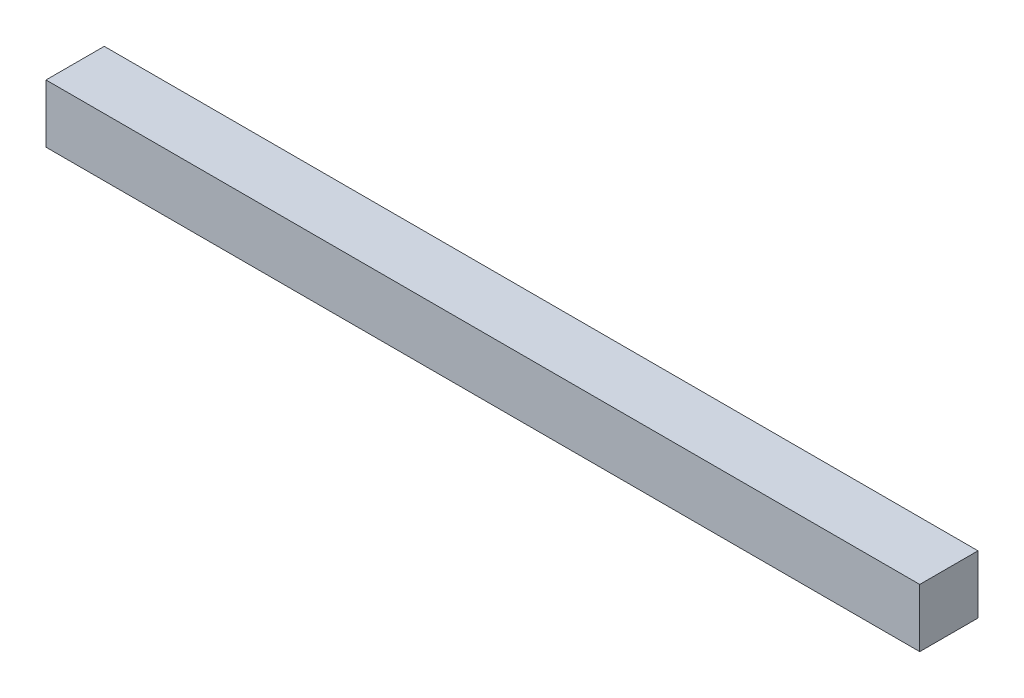
ISO-10303-21;
HEADER;
FILE_DESCRIPTION(('STEP AP214'),'2;1');
FILE_NAME('part.step','',(''),(''),'','','');
FILE_SCHEMA(('AUTOMOTIVE_DESIGN { 1 0 10303 214 1 1 1 1 }'));
ENDSEC;
DATA;
#1=APPLICATION_CONTEXT('core data for automotive mechanical design processes');
#2=APPLICATION_PROTOCOL_DEFINITION('international standard','automotive_design',2000,#1);
#3=PRODUCT_CONTEXT('',#1,'mechanical');
#4=PRODUCT('Part','Part','',(#3));
#5=PRODUCT_RELATED_PRODUCT_CATEGORY('part','',(#4));
#6=PRODUCT_DEFINITION_FORMATION('','',#4);
#7=PRODUCT_DEFINITION_CONTEXT('part definition',#1,'design');
#8=PRODUCT_DEFINITION('design','',#6,#7);
#9=PRODUCT_DEFINITION_SHAPE('','',#8);
#10=(LENGTH_UNIT() NAMED_UNIT(*) SI_UNIT(.MILLI.,.METRE.));
#11=(NAMED_UNIT(*) PLANE_ANGLE_UNIT() SI_UNIT($,.RADIAN.));
#12=(NAMED_UNIT(*) SI_UNIT($,.STERADIAN.) SOLID_ANGLE_UNIT());
#13=UNCERTAINTY_MEASURE_WITH_UNIT(LENGTH_MEASURE(1.E-05),#10,'distance_accuracy_value','');
#14=(GEOMETRIC_REPRESENTATION_CONTEXT(3) GLOBAL_UNCERTAINTY_ASSIGNED_CONTEXT((#13)) GLOBAL_UNIT_ASSIGNED_CONTEXT((#10,
#11,#12)) REPRESENTATION_CONTEXT('',''));
#15=CARTESIAN_POINT('',(0.,0.,0.));
#16=DIRECTION('',(0.,0.,1.));
#17=DIRECTION('',(1.,0.,0.));
#18=AXIS2_PLACEMENT_3D('',#15,#16,#17);
#19=CARTESIAN_POINT('',(75.,-5.,10.));
#20=DIRECTION('',(-1.,0.,0.));
#21=DIRECTION('',(0.,0.,1.));
#22=AXIS2_PLACEMENT_3D('',#19,#20,#21);
#23=PLANE('',#22);
#24=DIRECTION('',(0.,1.,0.));
#25=VECTOR('',#24,1.);
#26=CARTESIAN_POINT('',(75.,-5.,0.));
#27=LINE('',#26,#25);
#28=CARTESIAN_POINT('',(75.,-5.,0.));
#29=VERTEX_POINT('',#28);
#30=CARTESIAN_POINT('',(75.,5.,0.));
#31=VERTEX_POINT('',#30);
#32=EDGE_CURVE('E96',#29,#31,#27,.T.);
#33=ORIENTED_EDGE('',*,*,#32,.T.);
#34=DIRECTION('',(0.,0.,-1.));
#35=VECTOR('',#34,1.);
#36=CARTESIAN_POINT('',(75.,5.,10.));
#37=LINE('',#36,#35);
#38=CARTESIAN_POINT('',(75.,5.,10.));
#39=VERTEX_POINT('',#38);
#40=EDGE_CURVE('E11',#39,#31,#37,.T.);
#41=ORIENTED_EDGE('',*,*,#40,.F.);
#42=DIRECTION('',(0.,1.,0.));
#43=VECTOR('',#42,1.);
#44=CARTESIAN_POINT('',(75.,-5.,10.));
#45=LINE('',#44,#43);
#46=CARTESIAN_POINT('',(75.,-5.,10.));
#47=VERTEX_POINT('',#46);
#48=EDGE_CURVE('E84',#47,#39,#45,.T.);
#49=ORIENTED_EDGE('',*,*,#48,.F.);
#50=DIRECTION('',(0.,0.,-1.));
#51=VECTOR('',#50,1.);
#52=CARTESIAN_POINT('',(75.,-5.,10.));
#53=LINE('',#52,#51);
#54=EDGE_CURVE('E92',#47,#29,#53,.T.);
#55=ORIENTED_EDGE('',*,*,#54,.T.);
#56=EDGE_LOOP('',(#33,#41,#49,#55));
#57=FACE_BOUND('',#56,.T.);
#58=ADVANCED_FACE('F33',(#57),#23,.F.);
#59=CARTESIAN_POINT('',(-75.,5.,10.));
#60=DIRECTION('',(0.,-1.,0.));
#61=DIRECTION('',(0.,0.,-1.));
#62=AXIS2_PLACEMENT_3D('',#59,#60,#61);
#63=PLANE('',#62);
#64=DIRECTION('',(-1.,0.,0.));
#65=VECTOR('',#64,1.);
#66=CARTESIAN_POINT('',(-75.,5.,0.));
#67=LINE('',#66,#65);
#68=CARTESIAN_POINT('',(-75.,5.,0.));
#69=VERTEX_POINT('',#68);
#70=EDGE_CURVE('E88',#31,#69,#67,.T.);
#71=ORIENTED_EDGE('',*,*,#70,.T.);
#72=DIRECTION('',(0.,0.,-1.));
#73=VECTOR('',#72,1.);
#74=CARTESIAN_POINT('',(-75.,5.,10.));
#75=LINE('',#74,#73);
#76=CARTESIAN_POINT('',(-75.,5.,10.));
#77=VERTEX_POINT('',#76);
#78=EDGE_CURVE('E41',#77,#69,#75,.T.);
#79=ORIENTED_EDGE('',*,*,#78,.F.);
#80=DIRECTION('',(-1.,0.,0.));
#81=VECTOR('',#80,1.);
#82=CARTESIAN_POINT('',(-75.,5.,10.));
#83=LINE('',#82,#81);
#84=EDGE_CURVE('E79',#39,#77,#83,.T.);
#85=ORIENTED_EDGE('',*,*,#84,.F.);
#86=ORIENTED_EDGE('',*,*,#40,.T.);
#87=EDGE_LOOP('',(#71,#79,#85,#86));
#88=FACE_BOUND('',#87,.T.);
#89=ADVANCED_FACE('F87',(#88),#63,.F.);
#90=CARTESIAN_POINT('',(-75.,-5.,10.));
#91=DIRECTION('',(1.,0.,0.));
#92=DIRECTION('',(0.,0.,-1.));
#93=AXIS2_PLACEMENT_3D('',#90,#91,#92);
#94=PLANE('',#93);
#95=DIRECTION('',(0.,-1.,0.));
#96=VECTOR('',#95,1.);
#97=CARTESIAN_POINT('',(-75.,-5.,0.));
#98=LINE('',#97,#96);
#99=CARTESIAN_POINT('',(-75.,-5.,0.));
#100=VERTEX_POINT('',#99);
#101=EDGE_CURVE('E66',#69,#100,#98,.T.);
#102=ORIENTED_EDGE('',*,*,#101,.T.);
#103=DIRECTION('',(0.,0.,-1.));
#104=VECTOR('',#103,1.);
#105=CARTESIAN_POINT('',(-75.,-5.,10.));
#106=LINE('',#105,#104);
#107=CARTESIAN_POINT('',(-75.,-5.,10.));
#108=VERTEX_POINT('',#107);
#109=EDGE_CURVE('E89',#108,#100,#106,.T.);
#110=ORIENTED_EDGE('',*,*,#109,.F.);
#111=DIRECTION('',(0.,-1.,0.));
#112=VECTOR('',#111,1.);
#113=CARTESIAN_POINT('',(-75.,-5.,10.));
#114=LINE('',#113,#112);
#115=EDGE_CURVE('E82',#77,#108,#114,.T.);
#116=ORIENTED_EDGE('',*,*,#115,.F.);
#117=ORIENTED_EDGE('',*,*,#78,.T.);
#118=EDGE_LOOP('',(#102,#110,#116,#117));
#119=FACE_BOUND('',#118,.T.);
#120=ADVANCED_FACE('F90',(#119),#94,.F.);
#121=CARTESIAN_POINT('',(-75.,-5.,10.));
#122=DIRECTION('',(0.,1.,0.));
#123=DIRECTION('',(0.,0.,1.));
#124=AXIS2_PLACEMENT_3D('',#121,#122,#123);
#125=PLANE('',#124);
#126=DIRECTION('',(1.,0.,0.));
#127=VECTOR('',#126,1.);
#128=CARTESIAN_POINT('',(-75.,-5.,0.));
#129=LINE('',#128,#127);
#130=EDGE_CURVE('E72',#100,#29,#129,.T.);
#131=ORIENTED_EDGE('',*,*,#130,.T.);
#132=ORIENTED_EDGE('',*,*,#54,.F.);
#133=DIRECTION('',(1.,0.,0.));
#134=VECTOR('',#133,1.);
#135=CARTESIAN_POINT('',(-75.,-5.,10.));
#136=LINE('',#135,#134);
#137=EDGE_CURVE('E49',#108,#47,#136,.T.);
#138=ORIENTED_EDGE('',*,*,#137,.F.);
#139=ORIENTED_EDGE('',*,*,#109,.T.);
#140=EDGE_LOOP('',(#131,#132,#138,#139));
#141=FACE_BOUND('',#140,.T.);
#142=ADVANCED_FACE('F103',(#141),#125,.F.);
#143=CARTESIAN_POINT('',(0.,0.,10.));
#144=DIRECTION('',(0.,0.,-1.));
#145=DIRECTION('',(-1.,0.,0.));
#146=AXIS2_PLACEMENT_3D('',#143,#144,#145);
#147=PLANE('',#146);
#148=ORIENTED_EDGE('',*,*,#48,.T.);
#149=ORIENTED_EDGE('',*,*,#84,.T.);
#150=ORIENTED_EDGE('',*,*,#115,.T.);
#151=ORIENTED_EDGE('',*,*,#137,.T.);
#152=EDGE_LOOP('',(#148,#149,#150,#151));
#153=FACE_BOUND('',#152,.T.);
#154=ADVANCED_FACE('F80',(#153),#147,.F.);
#155=CARTESIAN_POINT('',(0.,0.,0.));
#156=DIRECTION('',(0.,0.,-1.));
#157=DIRECTION('',(-1.,0.,0.));
#158=AXIS2_PLACEMENT_3D('',#155,#156,#157);
#159=PLANE('',#158);
#160=ORIENTED_EDGE('',*,*,#32,.F.);
#161=ORIENTED_EDGE('',*,*,#130,.F.);
#162=ORIENTED_EDGE('',*,*,#101,.F.);
#163=ORIENTED_EDGE('',*,*,#70,.F.);
#164=EDGE_LOOP('',(#160,#161,#162,#163));
#165=FACE_BOUND('',#164,.T.);
#166=ADVANCED_FACE('F106',(#165),#159,.T.);
#167=CLOSED_SHELL('',(#58,#89,#120,#142,#154,#166));
#168=MANIFOLD_SOLID_BREP('B2',#167);
#169=ADVANCED_BREP_SHAPE_REPRESENTATION('',(#18,#168),#14);
#170=SHAPE_DEFINITION_REPRESENTATION(#9,#169);
ENDSEC;
END-ISO-10303-21;
